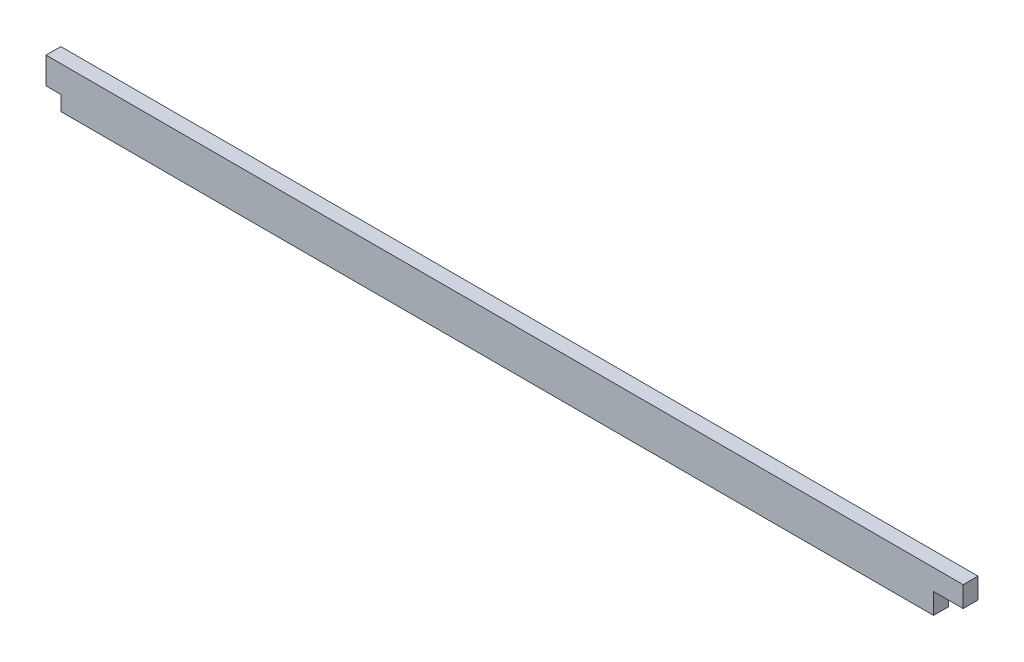
ISO-10303-21;
HEADER;
FILE_DESCRIPTION(('STEP AP214'),'2;1');
FILE_NAME('part.step','',(''),(''),'','','');
FILE_SCHEMA(('AUTOMOTIVE_DESIGN { 1 0 10303 214 1 1 1 1 }'));
ENDSEC;
DATA;
#1=APPLICATION_CONTEXT('core data for automotive mechanical design processes');
#2=APPLICATION_PROTOCOL_DEFINITION('international standard','automotive_design',2000,#1);
#3=PRODUCT_CONTEXT('',#1,'mechanical');
#4=PRODUCT('Part','Part','',(#3));
#5=PRODUCT_RELATED_PRODUCT_CATEGORY('part','',(#4));
#6=PRODUCT_DEFINITION_FORMATION('','',#4);
#7=PRODUCT_DEFINITION_CONTEXT('part definition',#1,'design');
#8=PRODUCT_DEFINITION('design','',#6,#7);
#9=PRODUCT_DEFINITION_SHAPE('','',#8);
#10=(LENGTH_UNIT() NAMED_UNIT(*) SI_UNIT(.MILLI.,.METRE.));
#11=(NAMED_UNIT(*) PLANE_ANGLE_UNIT() SI_UNIT($,.RADIAN.));
#12=(NAMED_UNIT(*) SI_UNIT($,.STERADIAN.) SOLID_ANGLE_UNIT());
#13=UNCERTAINTY_MEASURE_WITH_UNIT(LENGTH_MEASURE(1.E-05),#10,'distance_accuracy_value','');
#14=(GEOMETRIC_REPRESENTATION_CONTEXT(3) GLOBAL_UNCERTAINTY_ASSIGNED_CONTEXT((#13)) GLOBAL_UNIT_ASSIGNED_CONTEXT((#10,
#11,#12)) REPRESENTATION_CONTEXT('',''));
#15=CARTESIAN_POINT('',(0.,0.,0.));
#16=DIRECTION('',(0.,0.,1.));
#17=DIRECTION('',(1.,0.,0.));
#18=AXIS2_PLACEMENT_3D('',#15,#16,#17);
#19=CARTESIAN_POINT('',(86.7105886828403,0.,1.4));
#20=DIRECTION('',(-1.,0.,0.));
#21=DIRECTION('',(0.,0.,1.));
#22=AXIS2_PLACEMENT_3D('',#19,#20,#21);
#23=PLANE('',#22);
#24=DIRECTION('',(0.,1.,0.));
#25=VECTOR('',#24,1.);
#26=CARTESIAN_POINT('',(86.7105886828403,0.,-1.4));
#27=LINE('',#26,#25);
#28=CARTESIAN_POINT('',(86.7105886828403,0.,-1.4));
#29=VERTEX_POINT('',#28);
#30=CARTESIAN_POINT('',(86.7105886828403,3.92,-1.4));
#31=VERTEX_POINT('',#30);
#32=EDGE_CURVE('E128',#29,#31,#27,.T.);
#33=ORIENTED_EDGE('',*,*,#32,.T.);
#34=DIRECTION('',(0.,0.,-1.));
#35=VECTOR('',#34,1.);
#36=CARTESIAN_POINT('',(86.7105886828403,3.92,1.4));
#37=LINE('',#36,#35);
#38=CARTESIAN_POINT('',(86.7105886828403,3.92,1.4));
#39=VERTEX_POINT('',#38);
#40=EDGE_CURVE('E11',#39,#31,#37,.T.);
#41=ORIENTED_EDGE('',*,*,#40,.F.);
#42=DIRECTION('',(0.,1.,0.));
#43=VECTOR('',#42,1.);
#44=CARTESIAN_POINT('',(86.7105886828403,0.,1.4));
#45=LINE('',#44,#43);
#46=CARTESIAN_POINT('',(86.7105886828403,0.,1.4));
#47=VERTEX_POINT('',#46);
#48=EDGE_CURVE('E142',#47,#39,#45,.T.);
#49=ORIENTED_EDGE('',*,*,#48,.F.);
#50=DIRECTION('',(0.,0.,-1.));
#51=VECTOR('',#50,1.);
#52=CARTESIAN_POINT('',(86.7105886828403,0.,1.4));
#53=LINE('',#52,#51);
#54=EDGE_CURVE('E124',#47,#29,#53,.T.);
#55=ORIENTED_EDGE('',*,*,#54,.T.);
#56=EDGE_LOOP('',(#33,#41,#49,#55));
#57=FACE_BOUND('',#56,.T.);
#58=ADVANCED_FACE('F32',(#57),#23,.F.);
#59=CARTESIAN_POINT('',(-86.7105886828403,3.92,1.4));
#60=DIRECTION('',(0.,-1.,0.));
#61=DIRECTION('',(0.,0.,-1.));
#62=AXIS2_PLACEMENT_3D('',#59,#60,#61);
#63=PLANE('',#62);
#64=DIRECTION('',(-1.,0.,0.));
#65=VECTOR('',#64,1.);
#66=CARTESIAN_POINT('',(-86.7105886828403,3.92,-1.4));
#67=LINE('',#66,#65);
#68=CARTESIAN_POINT('',(-86.7105886828403,3.92,-1.4));
#69=VERTEX_POINT('',#68);
#70=EDGE_CURVE('E131',#31,#69,#67,.T.);
#71=ORIENTED_EDGE('',*,*,#70,.T.);
#72=DIRECTION('',(0.,0.,-1.));
#73=VECTOR('',#72,1.);
#74=CARTESIAN_POINT('',(-86.7105886828403,3.92,1.4));
#75=LINE('',#74,#73);
#76=CARTESIAN_POINT('',(-86.7105886828403,3.92,1.4));
#77=VERTEX_POINT('',#76);
#78=EDGE_CURVE('E40',#77,#69,#75,.T.);
#79=ORIENTED_EDGE('',*,*,#78,.F.);
#80=DIRECTION('',(-1.,0.,0.));
#81=VECTOR('',#80,1.);
#82=CARTESIAN_POINT('',(-43.0248795203083,3.92,1.4));
#83=LINE('',#82,#81);
#84=EDGE_CURVE('E91',#39,#77,#83,.T.);
#85=ORIENTED_EDGE('',*,*,#84,.F.);
#86=ORIENTED_EDGE('',*,*,#40,.T.);
#87=EDGE_LOOP('',(#71,#79,#85,#86));
#88=FACE_BOUND('',#87,.T.);
#89=ADVANCED_FACE('F177',(#88),#63,.F.);
#90=CARTESIAN_POINT('',(-86.7105886828403,-1.12,1.4));
#91=DIRECTION('',(1.,0.,0.));
#92=DIRECTION('',(0.,0.,-1.));
#93=AXIS2_PLACEMENT_3D('',#90,#91,#92);
#94=PLANE('',#93);
#95=DIRECTION('',(0.,-1.,0.));
#96=VECTOR('',#95,1.);
#97=CARTESIAN_POINT('',(-86.7105886828403,-1.12,-1.4));
#98=LINE('',#97,#96);
#99=CARTESIAN_POINT('',(-86.7105886828403,-1.12,-1.4));
#100=VERTEX_POINT('',#99);
#101=EDGE_CURVE('E133',#69,#100,#98,.T.);
#102=ORIENTED_EDGE('',*,*,#101,.T.);
#103=DIRECTION('',(0.,0.,-1.));
#104=VECTOR('',#103,1.);
#105=CARTESIAN_POINT('',(-86.7105886828403,-1.12,1.4));
#106=LINE('',#105,#104);
#107=CARTESIAN_POINT('',(-86.7105886828403,-1.12,1.4));
#108=VERTEX_POINT('',#107);
#109=EDGE_CURVE('E149',#108,#100,#106,.T.);
#110=ORIENTED_EDGE('',*,*,#109,.F.);
#111=DIRECTION('',(0.,-1.,0.));
#112=VECTOR('',#111,1.);
#113=CARTESIAN_POINT('',(-86.7105886828403,-1.12,1.4));
#114=LINE('',#113,#112);
#115=EDGE_CURVE('E157',#77,#108,#114,.T.);
#116=ORIENTED_EDGE('',*,*,#115,.F.);
#117=ORIENTED_EDGE('',*,*,#78,.T.);
#118=EDGE_LOOP('',(#102,#110,#116,#117));
#119=FACE_BOUND('',#118,.T.);
#120=ADVANCED_FACE('F155',(#119),#94,.F.);
#121=CARTESIAN_POINT('',(-86.7105886828403,-1.12,1.4));
#122=DIRECTION('',(0.,1.,0.));
#123=DIRECTION('',(0.,0.,1.));
#124=AXIS2_PLACEMENT_3D('',#121,#122,#123);
#125=PLANE('',#124);
#126=DIRECTION('',(1.,0.,0.));
#127=VECTOR('',#126,1.);
#128=CARTESIAN_POINT('',(-86.7105886828403,-1.12,-1.4));
#129=LINE('',#128,#127);
#130=CARTESIAN_POINT('',(-83.9105886828403,-1.12,-1.4));
#131=VERTEX_POINT('',#130);
#132=EDGE_CURVE('E135',#100,#131,#129,.T.);
#133=ORIENTED_EDGE('',*,*,#132,.T.);
#134=DIRECTION('',(0.,0.,-1.));
#135=VECTOR('',#134,1.);
#136=CARTESIAN_POINT('',(-83.9105886828403,-1.12,1.4));
#137=LINE('',#136,#135);
#138=CARTESIAN_POINT('',(-83.9105886828403,-1.12,1.4));
#139=VERTEX_POINT('',#138);
#140=EDGE_CURVE('E146',#139,#131,#137,.T.);
#141=ORIENTED_EDGE('',*,*,#140,.F.);
#142=DIRECTION('',(1.,0.,0.));
#143=VECTOR('',#142,1.);
#144=CARTESIAN_POINT('',(-86.7105886828403,-1.12,1.4));
#145=LINE('',#144,#143);
#146=EDGE_CURVE('E169',#108,#139,#145,.T.);
#147=ORIENTED_EDGE('',*,*,#146,.F.);
#148=ORIENTED_EDGE('',*,*,#109,.T.);
#149=EDGE_LOOP('',(#133,#141,#147,#148));
#150=FACE_BOUND('',#149,.T.);
#151=ADVANCED_FACE('F165',(#150),#125,.F.);
#152=CARTESIAN_POINT('',(-83.9105886828403,-1.12,1.4));
#153=DIRECTION('',(1.,0.,0.));
#154=DIRECTION('',(0.,0.,-1.));
#155=AXIS2_PLACEMENT_3D('',#152,#153,#154);
#156=PLANE('',#155);
#157=DIRECTION('',(0.,-1.,0.));
#158=VECTOR('',#157,1.);
#159=CARTESIAN_POINT('',(-83.9105886828403,-1.12,-1.4));
#160=LINE('',#159,#158);
#161=CARTESIAN_POINT('',(-83.9105886828403,-3.92,-1.4));
#162=VERTEX_POINT('',#161);
#163=EDGE_CURVE('E137',#131,#162,#160,.T.);
#164=ORIENTED_EDGE('',*,*,#163,.T.);
#165=DIRECTION('',(0.,0.,-1.));
#166=VECTOR('',#165,1.);
#167=CARTESIAN_POINT('',(-83.9105886828403,-3.92,1.4));
#168=LINE('',#167,#166);
#169=CARTESIAN_POINT('',(-83.9105886828403,-3.92,1.4));
#170=VERTEX_POINT('',#169);
#171=EDGE_CURVE('E119',#170,#162,#168,.T.);
#172=ORIENTED_EDGE('',*,*,#171,.F.);
#173=DIRECTION('',(0.,-1.,0.));
#174=VECTOR('',#173,1.);
#175=CARTESIAN_POINT('',(-83.9105886828403,-1.12,1.4));
#176=LINE('',#175,#174);
#177=EDGE_CURVE('E110',#139,#170,#176,.T.);
#178=ORIENTED_EDGE('',*,*,#177,.F.);
#179=ORIENTED_EDGE('',*,*,#140,.T.);
#180=EDGE_LOOP('',(#164,#172,#178,#179));
#181=FACE_BOUND('',#180,.T.);
#182=ADVANCED_FACE('F168',(#181),#156,.F.);
#183=CARTESIAN_POINT('',(-83.9105886828403,-3.92,1.4));
#184=DIRECTION('',(0.,1.,0.));
#185=DIRECTION('',(0.,0.,1.));
#186=AXIS2_PLACEMENT_3D('',#183,#184,#185);
#187=PLANE('',#186);
#188=DIRECTION('',(1.,0.,0.));
#189=VECTOR('',#188,1.);
#190=CARTESIAN_POINT('',(-83.9105886828403,-3.92,-1.4));
#191=LINE('',#190,#189);
#192=CARTESIAN_POINT('',(81.1105886828403,-3.92,-1.4));
#193=VERTEX_POINT('',#192);
#194=EDGE_CURVE('E118',#162,#193,#191,.T.);
#195=ORIENTED_EDGE('',*,*,#194,.T.);
#196=DIRECTION('',(0.,0.,-1.));
#197=VECTOR('',#196,1.);
#198=CARTESIAN_POINT('',(81.1105886828403,-3.92,1.4));
#199=LINE('',#198,#197);
#200=CARTESIAN_POINT('',(81.1105886828403,-3.92,1.4));
#201=VERTEX_POINT('',#200);
#202=EDGE_CURVE('E115',#201,#193,#199,.T.);
#203=ORIENTED_EDGE('',*,*,#202,.F.);
#204=DIRECTION('',(1.,0.,0.));
#205=VECTOR('',#204,1.);
#206=CARTESIAN_POINT('',(-83.9105886828403,-3.92,1.4));
#207=LINE('',#206,#205);
#208=EDGE_CURVE('E104',#170,#201,#207,.T.);
#209=ORIENTED_EDGE('',*,*,#208,.F.);
#210=ORIENTED_EDGE('',*,*,#171,.T.);
#211=EDGE_LOOP('',(#195,#203,#209,#210));
#212=FACE_BOUND('',#211,.T.);
#213=ADVANCED_FACE('F116',(#212),#187,.F.);
#214=CARTESIAN_POINT('',(81.1105886828403,0.,1.4));
#215=DIRECTION('',(-1.,0.,0.));
#216=DIRECTION('',(0.,0.,1.));
#217=AXIS2_PLACEMENT_3D('',#214,#215,#216);
#218=PLANE('',#217);
#219=DIRECTION('',(0.,1.,0.));
#220=VECTOR('',#219,1.);
#221=CARTESIAN_POINT('',(81.1105886828403,0.,-1.4));
#222=LINE('',#221,#220);
#223=CARTESIAN_POINT('',(81.1105886828403,0.,-1.4));
#224=VERTEX_POINT('',#223);
#225=EDGE_CURVE('E77',#193,#224,#222,.T.);
#226=ORIENTED_EDGE('',*,*,#225,.T.);
#227=DIRECTION('',(0.,0.,-1.));
#228=VECTOR('',#227,1.);
#229=CARTESIAN_POINT('',(81.1105886828403,0.,1.4));
#230=LINE('',#229,#228);
#231=CARTESIAN_POINT('',(81.1105886828403,0.,1.4));
#232=VERTEX_POINT('',#231);
#233=EDGE_CURVE('E120',#232,#224,#230,.T.);
#234=ORIENTED_EDGE('',*,*,#233,.F.);
#235=DIRECTION('',(0.,1.,0.));
#236=VECTOR('',#235,1.);
#237=CARTESIAN_POINT('',(81.1105886828403,0.,1.4));
#238=LINE('',#237,#236);
#239=EDGE_CURVE('E108',#201,#232,#238,.T.);
#240=ORIENTED_EDGE('',*,*,#239,.F.);
#241=ORIENTED_EDGE('',*,*,#202,.T.);
#242=EDGE_LOOP('',(#226,#234,#240,#241));
#243=FACE_BOUND('',#242,.T.);
#244=ADVANCED_FACE('F122',(#243),#218,.F.);
#245=CARTESIAN_POINT('',(86.7105886828403,0.,1.4));
#246=DIRECTION('',(0.,1.,0.));
#247=DIRECTION('',(-1.,0.,0.));
#248=AXIS2_PLACEMENT_3D('',#245,#246,#247);
#249=PLANE('',#248);
#250=DIRECTION('',(1.,0.,0.));
#251=VECTOR('',#250,1.);
#252=CARTESIAN_POINT('',(86.7105886828403,0.,-1.4));
#253=LINE('',#252,#251);
#254=EDGE_CURVE('E83',#224,#29,#253,.T.);
#255=ORIENTED_EDGE('',*,*,#254,.T.);
#256=ORIENTED_EDGE('',*,*,#54,.F.);
#257=DIRECTION('',(1.,0.,0.));
#258=VECTOR('',#257,1.);
#259=CARTESIAN_POINT('',(86.7105886828403,0.,1.4));
#260=LINE('',#259,#258);
#261=EDGE_CURVE('E48',#232,#47,#260,.T.);
#262=ORIENTED_EDGE('',*,*,#261,.F.);
#263=ORIENTED_EDGE('',*,*,#233,.T.);
#264=EDGE_LOOP('',(#255,#256,#262,#263));
#265=FACE_BOUND('',#264,.T.);
#266=ADVANCED_FACE('F193',(#265),#249,.F.);
#267=CARTESIAN_POINT('',(0.,0.,1.4));
#268=DIRECTION('',(0.,0.,-1.));
#269=DIRECTION('',(-1.,0.,0.));
#270=AXIS2_PLACEMENT_3D('',#267,#268,#269);
#271=PLANE('',#270);
#272=ORIENTED_EDGE('',*,*,#48,.T.);
#273=ORIENTED_EDGE('',*,*,#84,.T.);
#274=ORIENTED_EDGE('',*,*,#115,.T.);
#275=ORIENTED_EDGE('',*,*,#146,.T.);
#276=ORIENTED_EDGE('',*,*,#177,.T.);
#277=ORIENTED_EDGE('',*,*,#208,.T.);
#278=ORIENTED_EDGE('',*,*,#239,.T.);
#279=ORIENTED_EDGE('',*,*,#261,.T.);
#280=EDGE_LOOP('',(#272,#273,#274,#275,#276,#277,#278,#279));
#281=FACE_BOUND('',#280,.T.);
#282=ADVANCED_FACE('F106',(#281),#271,.F.);
#283=CARTESIAN_POINT('',(0.,0.,-1.4));
#284=DIRECTION('',(0.,0.,-1.));
#285=DIRECTION('',(-1.,0.,0.));
#286=AXIS2_PLACEMENT_3D('',#283,#284,#285);
#287=PLANE('',#286);
#288=ORIENTED_EDGE('',*,*,#32,.F.);
#289=ORIENTED_EDGE('',*,*,#254,.F.);
#290=ORIENTED_EDGE('',*,*,#225,.F.);
#291=ORIENTED_EDGE('',*,*,#194,.F.);
#292=ORIENTED_EDGE('',*,*,#163,.F.);
#293=ORIENTED_EDGE('',*,*,#132,.F.);
#294=ORIENTED_EDGE('',*,*,#101,.F.);
#295=ORIENTED_EDGE('',*,*,#70,.F.);
#296=EDGE_LOOP('',(#288,#289,#290,#291,#292,#293,#294,#295));
#297=FACE_BOUND('',#296,.T.);
#298=ADVANCED_FACE('F161',(#297),#287,.T.);
#299=CLOSED_SHELL('',(#58,#89,#120,#151,#182,#213,#244,#266,#282,#298));
#300=MANIFOLD_SOLID_BREP('B2',#299);
#301=ADVANCED_BREP_SHAPE_REPRESENTATION('',(#18,#300),#14);
#302=SHAPE_DEFINITION_REPRESENTATION(#9,#301);
ENDSEC;
END-ISO-10303-21;
